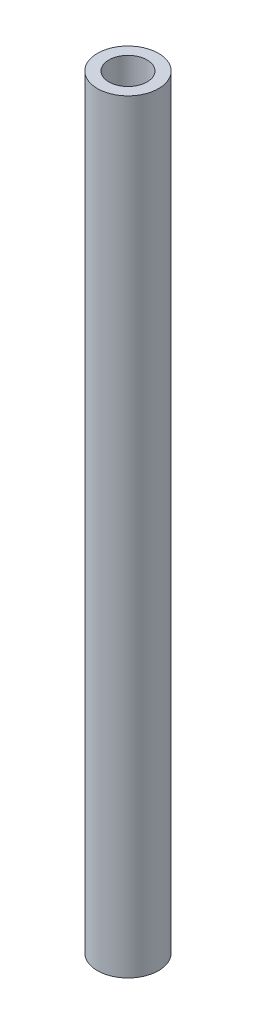
ISO-10303-21;
HEADER;
FILE_DESCRIPTION(('STEP AP214'),'2;1');
FILE_NAME('part.step','',(''),(''),'','','');
FILE_SCHEMA(('AUTOMOTIVE_DESIGN { 1 0 10303 214 1 1 1 1 }'));
ENDSEC;
DATA;
#1=APPLICATION_CONTEXT('core data for automotive mechanical design processes');
#2=APPLICATION_PROTOCOL_DEFINITION('international standard','automotive_design',2000,#1);
#3=PRODUCT_CONTEXT('',#1,'mechanical');
#4=PRODUCT('Part','Part','',(#3));
#5=PRODUCT_RELATED_PRODUCT_CATEGORY('part','',(#4));
#6=PRODUCT_DEFINITION_FORMATION('','',#4);
#7=PRODUCT_DEFINITION_CONTEXT('part definition',#1,'design');
#8=PRODUCT_DEFINITION('design','',#6,#7);
#9=PRODUCT_DEFINITION_SHAPE('','',#8);
#10=(LENGTH_UNIT() NAMED_UNIT(*) SI_UNIT(.MILLI.,.METRE.));
#11=(NAMED_UNIT(*) PLANE_ANGLE_UNIT() SI_UNIT($,.RADIAN.));
#12=(NAMED_UNIT(*) SI_UNIT($,.STERADIAN.) SOLID_ANGLE_UNIT());
#13=UNCERTAINTY_MEASURE_WITH_UNIT(LENGTH_MEASURE(1.E-05),#10,'distance_accuracy_value','');
#14=(GEOMETRIC_REPRESENTATION_CONTEXT(3) GLOBAL_UNCERTAINTY_ASSIGNED_CONTEXT((#13)) GLOBAL_UNIT_ASSIGNED_CONTEXT((#10,
#11,#12)) REPRESENTATION_CONTEXT('',''));
#15=CARTESIAN_POINT('',(0.,0.,0.));
#16=DIRECTION('',(0.,0.,1.));
#17=DIRECTION('',(1.,0.,0.));
#18=AXIS2_PLACEMENT_3D('',#15,#16,#17);
#19=CARTESIAN_POINT('',(0.,127.,0.));
#20=DIRECTION('',(0.,-1.,0.));
#21=DIRECTION('',(0.,0.,-1.));
#22=AXIS2_PLACEMENT_3D('',#19,#20,#21);
#23=CYLINDRICAL_SURFACE('',#22,5.08);
#24=CARTESIAN_POINT('',(0.,127.,0.));
#25=DIRECTION('',(0.,1.,0.));
#26=DIRECTION('',(0.,0.,1.));
#27=AXIS2_PLACEMENT_3D('',#24,#25,#26);
#28=CIRCLE('',#27,5.08);
#29=CARTESIAN_POINT('',(0.,127.,5.08));
#30=VERTEX_POINT('',#29);
#31=EDGE_CURVE('E10',#30,#30,#28,.T.);
#32=ORIENTED_EDGE('',*,*,#31,.F.);
#33=EDGE_LOOP('',(#32));
#34=FACE_BOUND('',#33,.T.);
#35=CARTESIAN_POINT('',(0.,0.,0.));
#36=DIRECTION('',(0.,1.,0.));
#37=DIRECTION('',(0.,0.,1.));
#38=AXIS2_PLACEMENT_3D('',#35,#36,#37);
#39=CIRCLE('',#38,5.08);
#40=CARTESIAN_POINT('',(0.,0.,5.08));
#41=VERTEX_POINT('',#40);
#42=EDGE_CURVE('E40',#41,#41,#39,.T.);
#43=ORIENTED_EDGE('',*,*,#42,.T.);
#44=EDGE_LOOP('',(#43));
#45=FACE_BOUND('',#44,.T.);
#46=ADVANCED_FACE('F37',(#34,#45),#23,.T.);
#47=CARTESIAN_POINT('',(0.,127.,0.));
#48=DIRECTION('',(0.,1.,0.));
#49=DIRECTION('',(0.,0.,1.));
#50=AXIS2_PLACEMENT_3D('',#47,#48,#49);
#51=PLANE('',#50);
#52=CARTESIAN_POINT('',(0.,127.,0.));
#53=DIRECTION('',(0.,-1.,0.));
#54=DIRECTION('',(0.,0.,-1.));
#55=AXIS2_PLACEMENT_3D('',#52,#53,#54);
#56=CIRCLE('',#55,3.175);
#57=CARTESIAN_POINT('',(0.,127.,-3.175));
#58=VERTEX_POINT('',#57);
#59=EDGE_CURVE('E49',#58,#58,#56,.T.);
#60=ORIENTED_EDGE('',*,*,#59,.T.);
#61=EDGE_LOOP('',(#60));
#62=FACE_BOUND('',#61,.T.);
#63=ORIENTED_EDGE('',*,*,#31,.T.);
#64=EDGE_LOOP('',(#63));
#65=FACE_BOUND('',#64,.T.);
#66=ADVANCED_FACE('F59',(#62,#65),#51,.T.);
#67=CARTESIAN_POINT('',(0.,0.,0.));
#68=DIRECTION('',(0.,1.,0.));
#69=DIRECTION('',(0.,0.,1.));
#70=AXIS2_PLACEMENT_3D('',#67,#68,#69);
#71=PLANE('',#70);
#72=CARTESIAN_POINT('',(0.,0.,0.));
#73=DIRECTION('',(0.,-1.,0.));
#74=DIRECTION('',(0.,0.,-1.));
#75=AXIS2_PLACEMENT_3D('',#72,#73,#74);
#76=CIRCLE('',#75,3.175);
#77=CARTESIAN_POINT('',(0.,0.,-3.175));
#78=VERTEX_POINT('',#77);
#79=EDGE_CURVE('E51',#78,#78,#76,.T.);
#80=ORIENTED_EDGE('',*,*,#79,.F.);
#81=EDGE_LOOP('',(#80));
#82=FACE_BOUND('',#81,.T.);
#83=ORIENTED_EDGE('',*,*,#42,.F.);
#84=EDGE_LOOP('',(#83));
#85=FACE_BOUND('',#84,.T.);
#86=ADVANCED_FACE('F64',(#82,#85),#71,.F.);
#87=CARTESIAN_POINT('',(0.,127.,0.));
#88=DIRECTION('',(0.,-1.,0.));
#89=DIRECTION('',(0.,0.,-1.));
#90=AXIS2_PLACEMENT_3D('',#87,#88,#89);
#91=CYLINDRICAL_SURFACE('',#90,3.175);
#92=ORIENTED_EDGE('',*,*,#59,.F.);
#93=EDGE_LOOP('',(#92));
#94=FACE_BOUND('',#93,.T.);
#95=ORIENTED_EDGE('',*,*,#79,.T.);
#96=EDGE_LOOP('',(#95));
#97=FACE_BOUND('',#96,.T.);
#98=ADVANCED_FACE('F61',(#94,#97),#91,.F.);
#99=CLOSED_SHELL('',(#46,#66,#86,#98));
#100=MANIFOLD_SOLID_BREP('B2',#99);
#101=ADVANCED_BREP_SHAPE_REPRESENTATION('',(#18,#100),#14);
#102=SHAPE_DEFINITION_REPRESENTATION(#9,#101);
ENDSEC;
END-ISO-10303-21;
